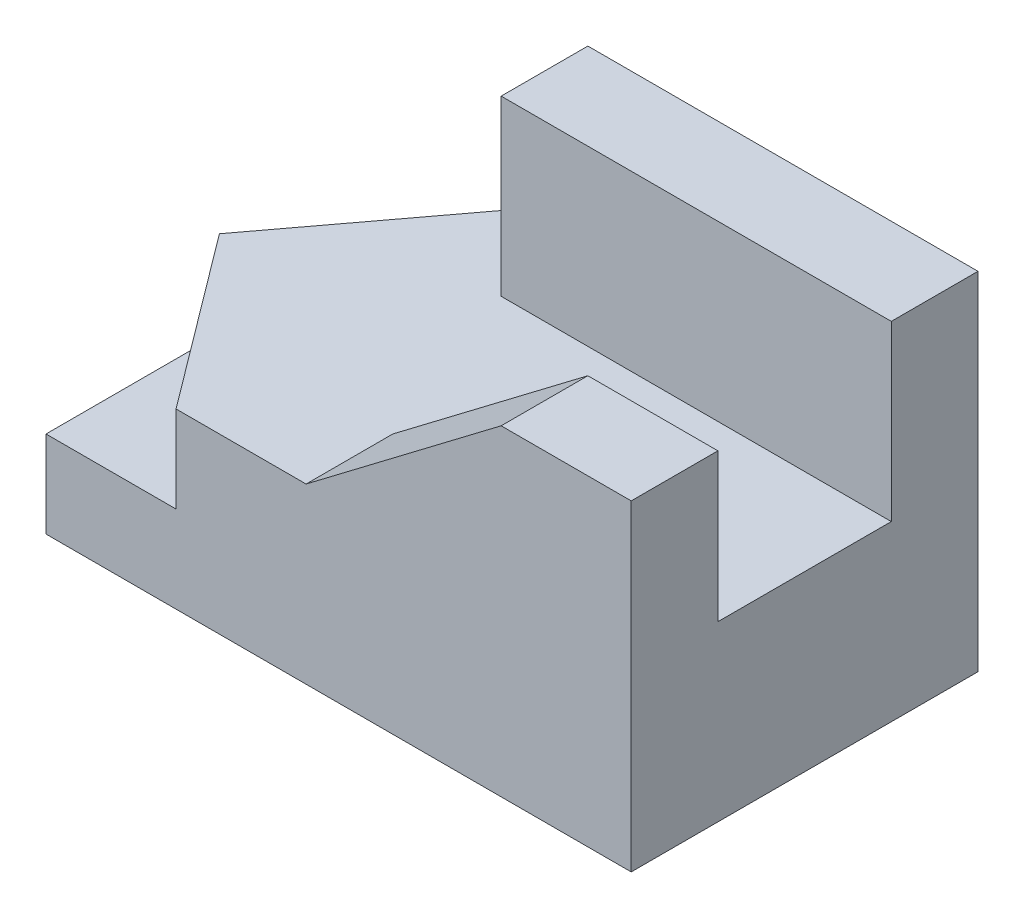
ISO-10303-21;
HEADER;
FILE_DESCRIPTION(('STEP AP214'),'2;1');
FILE_NAME('part.step','',(''),(''),'','','');
FILE_SCHEMA(('AUTOMOTIVE_DESIGN { 1 0 10303 214 1 1 1 1 }'));
ENDSEC;
DATA;
#1=APPLICATION_CONTEXT('core data for automotive mechanical design processes');
#2=APPLICATION_PROTOCOL_DEFINITION('international standard','automotive_design',2000,#1);
#3=PRODUCT_CONTEXT('',#1,'mechanical');
#4=PRODUCT('Part','Part','',(#3));
#5=PRODUCT_RELATED_PRODUCT_CATEGORY('part','',(#4));
#6=PRODUCT_DEFINITION_FORMATION('','',#4);
#7=PRODUCT_DEFINITION_CONTEXT('part definition',#1,'design');
#8=PRODUCT_DEFINITION('design','',#6,#7);
#9=PRODUCT_DEFINITION_SHAPE('','',#8);
#10=(LENGTH_UNIT() NAMED_UNIT(*) SI_UNIT(.MILLI.,.METRE.));
#11=(NAMED_UNIT(*) PLANE_ANGLE_UNIT() SI_UNIT($,.RADIAN.));
#12=(NAMED_UNIT(*) SI_UNIT($,.STERADIAN.) SOLID_ANGLE_UNIT());
#13=UNCERTAINTY_MEASURE_WITH_UNIT(LENGTH_MEASURE(1.E-05),#10,'distance_accuracy_value','');
#14=(GEOMETRIC_REPRESENTATION_CONTEXT(3) GLOBAL_UNCERTAINTY_ASSIGNED_CONTEXT((#13)) GLOBAL_UNIT_ASSIGNED_CONTEXT((#10,
#11,#12)) REPRESENTATION_CONTEXT('',''));
#15=CARTESIAN_POINT('',(0.,0.,0.));
#16=DIRECTION('',(0.,0.,1.));
#17=DIRECTION('',(1.,0.,0.));
#18=AXIS2_PLACEMENT_3D('',#15,#16,#17);
#19=CARTESIAN_POINT('',(0.,4.,0.));
#20=DIRECTION('',(0.,-1.,0.));
#21=DIRECTION('',(0.,0.,-1.));
#22=AXIS2_PLACEMENT_3D('',#19,#20,#21);
#23=PLANE('',#22);
#24=DIRECTION('',(0.,0.,1.));
#25=VECTOR('',#24,1.);
#26=CARTESIAN_POINT('',(-0.749999999999999,4.,4.));
#27=LINE('',#26,#25);
#28=CARTESIAN_POINT('',(-0.749999999999997,4.,2.));
#29=VERTEX_POINT('',#28);
#30=CARTESIAN_POINT('',(-0.749999999999997,4.,4.));
#31=VERTEX_POINT('',#30);
#32=EDGE_CURVE('E127',#29,#31,#27,.T.);
#33=ORIENTED_EDGE('',*,*,#32,.F.);
#34=DIRECTION('',(-1.,0.,0.));
#35=VECTOR('',#34,1.);
#36=CARTESIAN_POINT('',(-0.749999999999999,4.,2.));
#37=LINE('',#36,#35);
#38=CARTESIAN_POINT('',(6.75,4.,2.));
#39=VERTEX_POINT('',#38);
#40=EDGE_CURVE('E135',#39,#29,#37,.T.);
#41=ORIENTED_EDGE('',*,*,#40,.F.);
#42=DIRECTION('',(0.,0.,-1.));
#43=VECTOR('',#42,1.);
#44=CARTESIAN_POINT('',(6.75,4.,-4.));
#45=LINE('',#44,#43);
#46=CARTESIAN_POINT('',(6.75,4.,-2.));
#47=VERTEX_POINT('',#46);
#48=EDGE_CURVE('E149',#39,#47,#45,.T.);
#49=ORIENTED_EDGE('',*,*,#48,.T.);
#50=DIRECTION('',(1.,0.,0.));
#51=VECTOR('',#50,1.);
#52=CARTESIAN_POINT('',(6.75,4.,-2.));
#53=LINE('',#52,#51);
#54=CARTESIAN_POINT('',(-2.25,4.,-2.));
#55=VERTEX_POINT('',#54);
#56=EDGE_CURVE('E212',#55,#47,#53,.T.);
#57=ORIENTED_EDGE('',*,*,#56,.F.);
#58=DIRECTION('',(0.,0.,1.));
#59=VECTOR('',#58,1.);
#60=CARTESIAN_POINT('',(-2.25,4.,-4.));
#61=LINE('',#60,#59);
#62=CARTESIAN_POINT('',(-2.25,4.,-4.));
#63=VERTEX_POINT('',#62);
#64=EDGE_CURVE('E204',#63,#55,#61,.T.);
#65=ORIENTED_EDGE('',*,*,#64,.F.);
#66=DIRECTION('',(-1.,0.,0.));
#67=VECTOR('',#66,1.);
#68=CARTESIAN_POINT('',(-3.75,4.,-4.));
#69=LINE('',#68,#67);
#70=CARTESIAN_POINT('',(-3.75,4.,-4.));
#71=VERTEX_POINT('',#70);
#72=EDGE_CURVE('E151',#63,#71,#69,.T.);
#73=ORIENTED_EDGE('',*,*,#72,.T.);
#74=DIRECTION('',(-0.6,0.,0.8));
#75=VECTOR('',#74,1.);
#76=CARTESIAN_POINT('',(-6.75,4.,0.));
#77=LINE('',#76,#75);
#78=CARTESIAN_POINT('',(-6.75,4.,0.));
#79=VERTEX_POINT('',#78);
#80=EDGE_CURVE('E158',#71,#79,#77,.T.);
#81=ORIENTED_EDGE('',*,*,#80,.T.);
#82=DIRECTION('',(0.6,0.,0.8));
#83=VECTOR('',#82,1.);
#84=CARTESIAN_POINT('',(-3.75,4.,4.));
#85=LINE('',#84,#83);
#86=CARTESIAN_POINT('',(-3.75,4.,4.));
#87=VERTEX_POINT('',#86);
#88=EDGE_CURVE('E147',#79,#87,#85,.T.);
#89=ORIENTED_EDGE('',*,*,#88,.T.);
#90=DIRECTION('',(1.,0.,0.));
#91=VECTOR('',#90,1.);
#92=CARTESIAN_POINT('',(6.75,4.,4.));
#93=LINE('',#92,#91);
#94=EDGE_CURVE('E142',#87,#31,#93,.T.);
#95=ORIENTED_EDGE('',*,*,#94,.T.);
#96=EDGE_LOOP('',(#33,#41,#49,#57,#65,#73,#81,#89,#95));
#97=FACE_BOUND('',#96,.T.);
#98=ADVANCED_FACE('F33',(#97),#23,.F.);
#99=CARTESIAN_POINT('',(0.,2.,0.));
#100=DIRECTION('',(0.,-1.,0.));
#101=DIRECTION('',(0.,0.,-1.));
#102=AXIS2_PLACEMENT_3D('',#99,#100,#101);
#103=PLANE('',#102);
#104=DIRECTION('',(0.6,0.,0.8));
#105=VECTOR('',#104,1.);
#106=CARTESIAN_POINT('',(-3.75,2.,4.));
#107=LINE('',#106,#105);
#108=CARTESIAN_POINT('',(-6.75,2.,0.));
#109=VERTEX_POINT('',#108);
#110=CARTESIAN_POINT('',(-3.75,2.,4.));
#111=VERTEX_POINT('',#110);
#112=EDGE_CURVE('E161',#109,#111,#107,.T.);
#113=ORIENTED_EDGE('',*,*,#112,.F.);
#114=DIRECTION('',(0.,0.,1.));
#115=VECTOR('',#114,1.);
#116=CARTESIAN_POINT('',(-6.75,2.,4.));
#117=LINE('',#116,#115);
#118=CARTESIAN_POINT('',(-6.75,2.,4.));
#119=VERTEX_POINT('',#118);
#120=EDGE_CURVE('E177',#109,#119,#117,.T.);
#121=ORIENTED_EDGE('',*,*,#120,.T.);
#122=DIRECTION('',(1.,0.,0.));
#123=VECTOR('',#122,1.);
#124=CARTESIAN_POINT('',(-6.75,2.,4.));
#125=LINE('',#124,#123);
#126=EDGE_CURVE('E181',#119,#111,#125,.T.);
#127=ORIENTED_EDGE('',*,*,#126,.T.);
#128=EDGE_LOOP('',(#113,#121,#127));
#129=FACE_BOUND('',#128,.T.);
#130=ADVANCED_FACE('F259',(#129),#103,.F.);
#131=DIRECTION('',(-0.6,0.,0.8));
#132=VECTOR('',#131,1.);
#133=CARTESIAN_POINT('',(-6.75,2.,0.));
#134=LINE('',#133,#132);
#135=CARTESIAN_POINT('',(-3.75,2.,-4.));
#136=VERTEX_POINT('',#135);
#137=EDGE_CURVE('E153',#136,#109,#134,.T.);
#138=ORIENTED_EDGE('',*,*,#137,.F.);
#139=DIRECTION('',(-1.,0.,0.));
#140=VECTOR('',#139,1.);
#141=CARTESIAN_POINT('',(-6.75,2.,-4.));
#142=LINE('',#141,#140);
#143=CARTESIAN_POINT('',(-6.75,2.,-4.));
#144=VERTEX_POINT('',#143);
#145=EDGE_CURVE('E175',#136,#144,#142,.T.);
#146=ORIENTED_EDGE('',*,*,#145,.T.);
#147=EDGE_CURVE('E179',#144,#109,#117,.T.);
#148=ORIENTED_EDGE('',*,*,#147,.T.);
#149=EDGE_LOOP('',(#138,#146,#148));
#150=FACE_BOUND('',#149,.T.);
#151=ADVANCED_FACE('F264',(#150),#103,.F.);
#152=CARTESIAN_POINT('',(6.75,2.,4.));
#153=DIRECTION('',(-1.,0.,0.));
#154=DIRECTION('',(0.,0.,1.));
#155=AXIS2_PLACEMENT_3D('',#152,#153,#154);
#156=PLANE('',#155);
#157=DIRECTION('',(0.,-1.,0.));
#158=VECTOR('',#157,1.);
#159=CARTESIAN_POINT('',(6.75,8.,2.));
#160=LINE('',#159,#158);
#161=CARTESIAN_POINT('',(6.75,7.41339854328956,2.));
#162=VERTEX_POINT('',#161);
#163=EDGE_CURVE('E55',#162,#39,#160,.T.);
#164=ORIENTED_EDGE('',*,*,#163,.F.);
#165=DIRECTION('',(0.,0.,1.));
#166=VECTOR('',#165,1.);
#167=CARTESIAN_POINT('',(6.75,7.41339854328956,0.));
#168=LINE('',#167,#166);
#169=CARTESIAN_POINT('',(6.75,7.41339854328956,4.));
#170=VERTEX_POINT('',#169);
#171=EDGE_CURVE('E136',#162,#170,#168,.T.);
#172=ORIENTED_EDGE('',*,*,#171,.T.);
#173=DIRECTION('',(0.,-1.,0.));
#174=VECTOR('',#173,1.);
#175=CARTESIAN_POINT('',(6.75,2.,4.));
#176=LINE('',#175,#174);
#177=CARTESIAN_POINT('',(6.75,0.,4.));
#178=VERTEX_POINT('',#177);
#179=EDGE_CURVE('E183',#170,#178,#176,.T.);
#180=ORIENTED_EDGE('',*,*,#179,.T.);
#181=DIRECTION('',(0.,0.,-1.));
#182=VECTOR('',#181,1.);
#183=CARTESIAN_POINT('',(6.75,0.,4.));
#184=LINE('',#183,#182);
#185=CARTESIAN_POINT('',(6.75,0.,-4.));
#186=VERTEX_POINT('',#185);
#187=EDGE_CURVE('E174',#178,#186,#184,.T.);
#188=ORIENTED_EDGE('',*,*,#187,.T.);
#189=DIRECTION('',(0.,-1.,0.));
#190=VECTOR('',#189,1.);
#191=CARTESIAN_POINT('',(6.75,2.,-4.));
#192=LINE('',#191,#190);
#193=CARTESIAN_POINT('',(6.75,8.,-4.));
#194=VERTEX_POINT('',#193);
#195=EDGE_CURVE('E199',#194,#186,#192,.T.);
#196=ORIENTED_EDGE('',*,*,#195,.F.);
#197=DIRECTION('',(0.,0.,-1.));
#198=VECTOR('',#197,1.);
#199=CARTESIAN_POINT('',(6.75,8.,-4.));
#200=LINE('',#199,#198);
#201=CARTESIAN_POINT('',(6.75,8.,-2.));
#202=VERTEX_POINT('',#201);
#203=EDGE_CURVE('E208',#202,#194,#200,.T.);
#204=ORIENTED_EDGE('',*,*,#203,.F.);
#205=DIRECTION('',(0.,-1.,0.));
#206=VECTOR('',#205,1.);
#207=CARTESIAN_POINT('',(6.75,8.,-2.));
#208=LINE('',#207,#206);
#209=EDGE_CURVE('E218',#202,#47,#208,.T.);
#210=ORIENTED_EDGE('',*,*,#209,.T.);
#211=ORIENTED_EDGE('',*,*,#48,.F.);
#212=EDGE_LOOP('',(#164,#172,#180,#188,#196,#204,#210,#211));
#213=FACE_BOUND('',#212,.T.);
#214=ADVANCED_FACE('F35',(#213),#156,.F.);
#215=CARTESIAN_POINT('',(-6.75,2.,-4.));
#216=DIRECTION('',(0.,0.,1.));
#217=DIRECTION('',(1.,0.,0.));
#218=AXIS2_PLACEMENT_3D('',#215,#216,#217);
#219=PLANE('',#218);
#220=DIRECTION('',(-1.,0.,0.));
#221=VECTOR('',#220,1.);
#222=CARTESIAN_POINT('',(-6.75,0.,-4.));
#223=LINE('',#222,#221);
#224=CARTESIAN_POINT('',(-6.75,0.,-4.));
#225=VERTEX_POINT('',#224);
#226=EDGE_CURVE('E186',#186,#225,#223,.T.);
#227=ORIENTED_EDGE('',*,*,#226,.T.);
#228=DIRECTION('',(0.,-1.,0.));
#229=VECTOR('',#228,1.);
#230=CARTESIAN_POINT('',(-6.75,2.,-4.));
#231=LINE('',#230,#229);
#232=EDGE_CURVE('E196',#144,#225,#231,.T.);
#233=ORIENTED_EDGE('',*,*,#232,.F.);
#234=ORIENTED_EDGE('',*,*,#145,.F.);
#235=DIRECTION('',(0.,-1.,0.));
#236=VECTOR('',#235,1.);
#237=CARTESIAN_POINT('',(-3.75,4.,-4.));
#238=LINE('',#237,#236);
#239=EDGE_CURVE('E169',#71,#136,#238,.T.);
#240=ORIENTED_EDGE('',*,*,#239,.F.);
#241=ORIENTED_EDGE('',*,*,#72,.F.);
#242=DIRECTION('',(0.,-1.,0.));
#243=VECTOR('',#242,1.);
#244=CARTESIAN_POINT('',(-2.25,8.,-4.));
#245=LINE('',#244,#243);
#246=CARTESIAN_POINT('',(-2.25,8.,-4.));
#247=VERTEX_POINT('',#246);
#248=EDGE_CURVE('E164',#247,#63,#245,.T.);
#249=ORIENTED_EDGE('',*,*,#248,.F.);
#250=DIRECTION('',(-1.,0.,0.));
#251=VECTOR('',#250,1.);
#252=CARTESIAN_POINT('',(6.75,8.,-4.));
#253=LINE('',#252,#251);
#254=EDGE_CURVE('E211',#194,#247,#253,.T.);
#255=ORIENTED_EDGE('',*,*,#254,.F.);
#256=ORIENTED_EDGE('',*,*,#195,.T.);
#257=EDGE_LOOP('',(#227,#233,#234,#240,#241,#249,#255,#256));
#258=FACE_BOUND('',#257,.T.);
#259=ADVANCED_FACE('F236',(#258),#219,.F.);
#260=CARTESIAN_POINT('',(-6.75,2.,4.));
#261=DIRECTION('',(1.,0.,0.));
#262=DIRECTION('',(0.,0.,-1.));
#263=AXIS2_PLACEMENT_3D('',#260,#261,#262);
#264=PLANE('',#263);
#265=DIRECTION('',(0.,0.,1.));
#266=VECTOR('',#265,1.);
#267=CARTESIAN_POINT('',(-6.75,0.,4.));
#268=LINE('',#267,#266);
#269=CARTESIAN_POINT('',(-6.75,0.,4.));
#270=VERTEX_POINT('',#269);
#271=EDGE_CURVE('E188',#225,#270,#268,.T.);
#272=ORIENTED_EDGE('',*,*,#271,.T.);
#273=DIRECTION('',(0.,-1.,0.));
#274=VECTOR('',#273,1.);
#275=CARTESIAN_POINT('',(-6.75,2.,4.));
#276=LINE('',#275,#274);
#277=EDGE_CURVE('E193',#119,#270,#276,.T.);
#278=ORIENTED_EDGE('',*,*,#277,.F.);
#279=ORIENTED_EDGE('',*,*,#120,.F.);
#280=ORIENTED_EDGE('',*,*,#147,.F.);
#281=ORIENTED_EDGE('',*,*,#232,.T.);
#282=EDGE_LOOP('',(#272,#278,#279,#280,#281));
#283=FACE_BOUND('',#282,.T.);
#284=ADVANCED_FACE('F283',(#283),#264,.F.);
#285=CARTESIAN_POINT('',(-6.75,2.,4.));
#286=DIRECTION('',(0.,0.,-1.));
#287=DIRECTION('',(-1.,0.,0.));
#288=AXIS2_PLACEMENT_3D('',#285,#286,#287);
#289=PLANE('',#288);
#290=ORIENTED_EDGE('',*,*,#179,.F.);
#291=DIRECTION('',(1.,0.,0.));
#292=VECTOR('',#291,1.);
#293=CARTESIAN_POINT('',(6.75,7.41339854328956,4.));
#294=LINE('',#293,#292);
#295=CARTESIAN_POINT('',(3.75,7.41339854328956,4.));
#296=VERTEX_POINT('',#295);
#297=EDGE_CURVE('E144',#296,#170,#294,.T.);
#298=ORIENTED_EDGE('',*,*,#297,.F.);
#299=DIRECTION('',(0.796724906409476,0.604342141097915,0.));
#300=VECTOR('',#299,1.);
#301=CARTESIAN_POINT('',(3.75,7.41339854328956,4.));
#302=LINE('',#301,#300);
#303=EDGE_CURVE('E130',#31,#296,#302,.T.);
#304=ORIENTED_EDGE('',*,*,#303,.F.);
#305=ORIENTED_EDGE('',*,*,#94,.F.);
#306=DIRECTION('',(0.,-1.,0.));
#307=VECTOR('',#306,1.);
#308=CARTESIAN_POINT('',(-3.75,4.,4.));
#309=LINE('',#308,#307);
#310=EDGE_CURVE('E172',#87,#111,#309,.T.);
#311=ORIENTED_EDGE('',*,*,#310,.T.);
#312=ORIENTED_EDGE('',*,*,#126,.F.);
#313=ORIENTED_EDGE('',*,*,#277,.T.);
#314=DIRECTION('',(1.,0.,0.));
#315=VECTOR('',#314,1.);
#316=CARTESIAN_POINT('',(-6.75,0.,4.));
#317=LINE('',#316,#315);
#318=EDGE_CURVE('E178',#270,#178,#317,.T.);
#319=ORIENTED_EDGE('',*,*,#318,.T.);
#320=EDGE_LOOP('',(#290,#298,#304,#305,#311,#312,#313,#319));
#321=FACE_BOUND('',#320,.T.);
#322=ADVANCED_FACE('F140',(#321),#289,.F.);
#323=CARTESIAN_POINT('',(0.,0.,0.));
#324=DIRECTION('',(0.,-1.,0.));
#325=DIRECTION('',(0.,0.,-1.));
#326=AXIS2_PLACEMENT_3D('',#323,#324,#325);
#327=PLANE('',#326);
#328=ORIENTED_EDGE('',*,*,#187,.F.);
#329=ORIENTED_EDGE('',*,*,#318,.F.);
#330=ORIENTED_EDGE('',*,*,#271,.F.);
#331=ORIENTED_EDGE('',*,*,#226,.F.);
#332=EDGE_LOOP('',(#328,#329,#330,#331));
#333=FACE_BOUND('',#332,.T.);
#334=ADVANCED_FACE('F275',(#333),#327,.T.);
#335=CARTESIAN_POINT('',(-3.75,4.,4.));
#336=DIRECTION('',(0.8,0.,-0.6));
#337=DIRECTION('',(-0.6,0.,-0.8));
#338=AXIS2_PLACEMENT_3D('',#335,#336,#337);
#339=PLANE('',#338);
#340=ORIENTED_EDGE('',*,*,#112,.T.);
#341=ORIENTED_EDGE('',*,*,#310,.F.);
#342=ORIENTED_EDGE('',*,*,#88,.F.);
#343=DIRECTION('',(0.,-1.,0.));
#344=VECTOR('',#343,1.);
#345=CARTESIAN_POINT('',(-6.75,4.,0.));
#346=LINE('',#345,#344);
#347=EDGE_CURVE('E160',#79,#109,#346,.T.);
#348=ORIENTED_EDGE('',*,*,#347,.T.);
#349=EDGE_LOOP('',(#340,#341,#342,#348));
#350=FACE_BOUND('',#349,.T.);
#351=ADVANCED_FACE('F272',(#350),#339,.F.);
#352=CARTESIAN_POINT('',(-6.75,4.,0.));
#353=DIRECTION('',(0.8,0.,0.6));
#354=DIRECTION('',(0.6,0.,-0.8));
#355=AXIS2_PLACEMENT_3D('',#352,#353,#354);
#356=PLANE('',#355);
#357=ORIENTED_EDGE('',*,*,#137,.T.);
#358=ORIENTED_EDGE('',*,*,#347,.F.);
#359=ORIENTED_EDGE('',*,*,#80,.F.);
#360=ORIENTED_EDGE('',*,*,#239,.T.);
#361=EDGE_LOOP('',(#357,#358,#359,#360));
#362=FACE_BOUND('',#361,.T.);
#363=ADVANCED_FACE('F269',(#362),#356,.F.);
#364=CARTESIAN_POINT('',(-2.25,8.,-4.));
#365=DIRECTION('',(1.,0.,0.));
#366=DIRECTION('',(0.,0.,-1.));
#367=AXIS2_PLACEMENT_3D('',#364,#365,#366);
#368=PLANE('',#367);
#369=ORIENTED_EDGE('',*,*,#64,.T.);
#370=DIRECTION('',(0.,-1.,0.));
#371=VECTOR('',#370,1.);
#372=CARTESIAN_POINT('',(-2.25,8.,-2.));
#373=LINE('',#372,#371);
#374=CARTESIAN_POINT('',(-2.25,8.,-2.));
#375=VERTEX_POINT('',#374);
#376=EDGE_CURVE('E225',#375,#55,#373,.T.);
#377=ORIENTED_EDGE('',*,*,#376,.F.);
#378=DIRECTION('',(0.,0.,1.));
#379=VECTOR('',#378,1.);
#380=CARTESIAN_POINT('',(-2.25,8.,-4.));
#381=LINE('',#380,#379);
#382=EDGE_CURVE('E214',#247,#375,#381,.T.);
#383=ORIENTED_EDGE('',*,*,#382,.F.);
#384=ORIENTED_EDGE('',*,*,#248,.T.);
#385=EDGE_LOOP('',(#369,#377,#383,#384));
#386=FACE_BOUND('',#385,.T.);
#387=ADVANCED_FACE('F231',(#386),#368,.F.);
#388=CARTESIAN_POINT('',(6.75,8.,-2.));
#389=DIRECTION('',(0.,0.,-1.));
#390=DIRECTION('',(-1.,0.,0.));
#391=AXIS2_PLACEMENT_3D('',#388,#389,#390);
#392=PLANE('',#391);
#393=ORIENTED_EDGE('',*,*,#56,.T.);
#394=ORIENTED_EDGE('',*,*,#209,.F.);
#395=DIRECTION('',(1.,0.,0.));
#396=VECTOR('',#395,1.);
#397=CARTESIAN_POINT('',(6.75,8.,-2.));
#398=LINE('',#397,#396);
#399=EDGE_CURVE('E216',#375,#202,#398,.T.);
#400=ORIENTED_EDGE('',*,*,#399,.F.);
#401=ORIENTED_EDGE('',*,*,#376,.T.);
#402=EDGE_LOOP('',(#393,#394,#400,#401));
#403=FACE_BOUND('',#402,.T.);
#404=ADVANCED_FACE('F243',(#403),#392,.F.);
#405=CARTESIAN_POINT('',(0.,8.,0.));
#406=DIRECTION('',(0.,-1.,0.));
#407=DIRECTION('',(0.,0.,-1.));
#408=AXIS2_PLACEMENT_3D('',#405,#406,#407);
#409=PLANE('',#408);
#410=ORIENTED_EDGE('',*,*,#203,.T.);
#411=ORIENTED_EDGE('',*,*,#254,.T.);
#412=ORIENTED_EDGE('',*,*,#382,.T.);
#413=ORIENTED_EDGE('',*,*,#399,.T.);
#414=EDGE_LOOP('',(#410,#411,#412,#413));
#415=FACE_BOUND('',#414,.T.);
#416=ADVANCED_FACE('F248',(#415),#409,.F.);
#417=CARTESIAN_POINT('',(-0.749999999999999,8.,2.));
#418=DIRECTION('',(0.,0.,1.));
#419=DIRECTION('',(1.,0.,0.));
#420=AXIS2_PLACEMENT_3D('',#417,#418,#419);
#421=PLANE('',#420);
#422=DIRECTION('',(0.796724906409476,0.604342141097915,0.));
#423=VECTOR('',#422,1.);
#424=CARTESIAN_POINT('',(1.17597774322216,5.46091769402725,2.));
#425=LINE('',#424,#423);
#426=CARTESIAN_POINT('',(3.75,7.41339854328956,2.));
#427=VERTEX_POINT('',#426);
#428=EDGE_CURVE('E41',#29,#427,#425,.T.);
#429=ORIENTED_EDGE('',*,*,#428,.T.);
#430=DIRECTION('',(1.,0.,0.));
#431=VECTOR('',#430,1.);
#432=CARTESIAN_POINT('',(-0.749999999999999,7.41339854328956,2.));
#433=LINE('',#432,#431);
#434=EDGE_CURVE('E11',#427,#162,#433,.T.);
#435=ORIENTED_EDGE('',*,*,#434,.T.);
#436=ORIENTED_EDGE('',*,*,#163,.T.);
#437=ORIENTED_EDGE('',*,*,#40,.T.);
#438=EDGE_LOOP('',(#429,#435,#436,#437));
#439=FACE_BOUND('',#438,.T.);
#440=ADVANCED_FACE('F201',(#439),#421,.F.);
#441=CARTESIAN_POINT('',(6.75,7.41339854328956,0.));
#442=DIRECTION('',(0.,-1.,0.));
#443=DIRECTION('',(1.,0.,0.));
#444=AXIS2_PLACEMENT_3D('',#441,#442,#443);
#445=PLANE('',#444);
#446=DIRECTION('',(0.,0.,1.));
#447=VECTOR('',#446,1.);
#448=CARTESIAN_POINT('',(3.75,7.41339854328956,0.));
#449=LINE('',#448,#447);
#450=EDGE_CURVE('E48',#427,#296,#449,.T.);
#451=ORIENTED_EDGE('',*,*,#450,.T.);
#452=ORIENTED_EDGE('',*,*,#297,.T.);
#453=ORIENTED_EDGE('',*,*,#171,.F.);
#454=ORIENTED_EDGE('',*,*,#434,.F.);
#455=EDGE_LOOP('',(#451,#452,#453,#454));
#456=FACE_BOUND('',#455,.T.);
#457=ADVANCED_FACE('F255',(#456),#445,.F.);
#458=CARTESIAN_POINT('',(3.75,7.41339854328956,0.));
#459=DIRECTION('',(0.604342141097915,-0.796724906409476,0.));
#460=DIRECTION('',(0.796724906409476,0.604342141097915,0.));
#461=AXIS2_PLACEMENT_3D('',#458,#459,#460);
#462=PLANE('',#461);
#463=ORIENTED_EDGE('',*,*,#32,.T.);
#464=ORIENTED_EDGE('',*,*,#303,.T.);
#465=ORIENTED_EDGE('',*,*,#450,.F.);
#466=ORIENTED_EDGE('',*,*,#428,.F.);
#467=EDGE_LOOP('',(#463,#464,#465,#466));
#468=FACE_BOUND('',#467,.T.);
#469=ADVANCED_FACE('F129',(#468),#462,.F.);
#470=CLOSED_SHELL('',(#98,#130,#151,#214,#259,#284,#322,#334,#351,#363,#387,#404,#416,#440,#457,#469));
#471=MANIFOLD_SOLID_BREP('B2',#470);
#472=ADVANCED_BREP_SHAPE_REPRESENTATION('',(#18,#471),#14);
#473=SHAPE_DEFINITION_REPRESENTATION(#9,#472);
ENDSEC;
END-ISO-10303-21;
